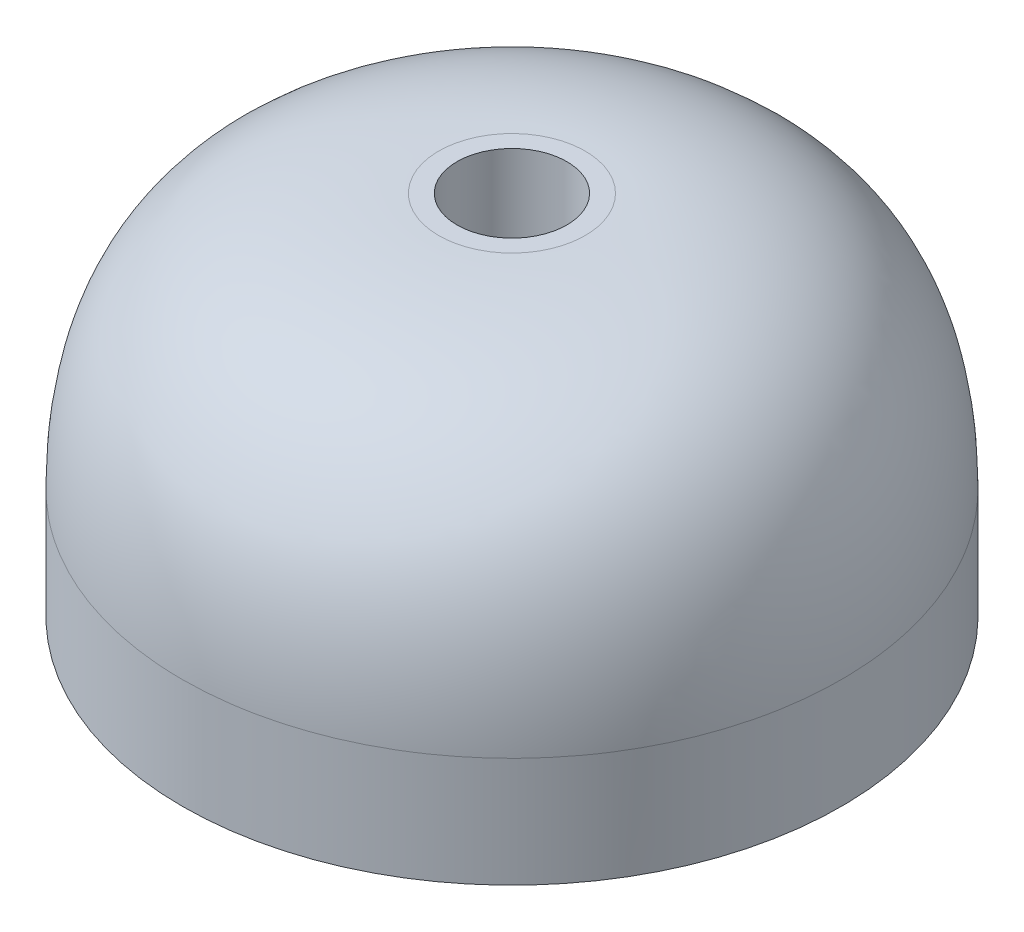
ISO-10303-21;
HEADER;
FILE_DESCRIPTION(('STEP AP214'),'2;1');
FILE_NAME('part.step','',(''),(''),'','','');
FILE_SCHEMA(('AUTOMOTIVE_DESIGN { 1 0 10303 214 1 1 1 1 }'));
ENDSEC;
DATA;
#1=APPLICATION_CONTEXT('core data for automotive mechanical design processes');
#2=APPLICATION_PROTOCOL_DEFINITION('international standard','automotive_design',2000,#1);
#3=PRODUCT_CONTEXT('',#1,'mechanical');
#4=PRODUCT('Part','Part','',(#3));
#5=PRODUCT_RELATED_PRODUCT_CATEGORY('part','',(#4));
#6=PRODUCT_DEFINITION_FORMATION('','',#4);
#7=PRODUCT_DEFINITION_CONTEXT('part definition',#1,'design');
#8=PRODUCT_DEFINITION('design','',#6,#7);
#9=PRODUCT_DEFINITION_SHAPE('','',#8);
#10=(LENGTH_UNIT() NAMED_UNIT(*) SI_UNIT(.MILLI.,.METRE.));
#11=(NAMED_UNIT(*) PLANE_ANGLE_UNIT() SI_UNIT($,.RADIAN.));
#12=(NAMED_UNIT(*) SI_UNIT($,.STERADIAN.) SOLID_ANGLE_UNIT());
#13=UNCERTAINTY_MEASURE_WITH_UNIT(LENGTH_MEASURE(1.E-05),#10,'distance_accuracy_value','');
#14=(GEOMETRIC_REPRESENTATION_CONTEXT(3) GLOBAL_UNCERTAINTY_ASSIGNED_CONTEXT((#13)) GLOBAL_UNIT_ASSIGNED_CONTEXT((#10,
#11,#12)) REPRESENTATION_CONTEXT('',''));
#15=CARTESIAN_POINT('',(0.,0.,0.));
#16=DIRECTION('',(0.,0.,1.));
#17=DIRECTION('',(1.,0.,0.));
#18=AXIS2_PLACEMENT_3D('',#15,#16,#17);
#19=CARTESIAN_POINT('',(0.,10.,0.));
#20=DIRECTION('',(0.,-1.,0.));
#21=DIRECTION('',(0.,0.,-1.));
#22=AXIS2_PLACEMENT_3D('',#19,#20,#21);
#23=CYLINDRICAL_SURFACE('',#22,9.);
#24=CARTESIAN_POINT('',(0.,3.,9.));
#25=CARTESIAN_POINT('',(1.17809719600875,3.,9.));
#26=CARTESIAN_POINT('',(2.3557310045845,3.,8.76575407122985));
#27=CARTESIAN_POINT('',(4.53257077798711,3.,7.86407751397331));
#28=CARTESIAN_POINT('',(5.53092051448413,3.,7.19700154687372));
#29=CARTESIAN_POINT('',(7.19700154687372,3.,5.53092051448413));
#30=CARTESIAN_POINT('',(7.86407751397326,3.,4.53257077798725));
#31=CARTESIAN_POINT('',(8.7657540712299,3.,2.35573100458436));
#32=CARTESIAN_POINT('',(9.,3.,1.17809719600879));
#33=CARTESIAN_POINT('',(9.,3.,-1.17809719600879));
#34=CARTESIAN_POINT('',(8.7657540712299,3.,-2.35573100458438));
#35=CARTESIAN_POINT('',(7.86407751397326,3.,-4.53257077798724));
#36=CARTESIAN_POINT('',(7.19700154687346,3.,-5.53092051448439));
#37=CARTESIAN_POINT('',(5.53092051448438,3.,-7.19700154687347));
#38=CARTESIAN_POINT('',(4.53257077798728,3.,-7.86407751397324));
#39=CARTESIAN_POINT('',(2.35573100458436,3.,-8.76575407122991));
#40=CARTESIAN_POINT('',(1.17809719600879,3.,-9.));
#41=CARTESIAN_POINT('',(-1.17809719600879,3.,-9.));
#42=CARTESIAN_POINT('',(-2.35573100458426,3.,-8.76575407122995));
#43=CARTESIAN_POINT('',(-4.53257077798734,3.,-7.86407751397322));
#44=CARTESIAN_POINT('',(-5.53092051448428,3.,-7.19700154687358));
#45=CARTESIAN_POINT('',(-7.19700154687358,3.,-5.53092051448427));
#46=CARTESIAN_POINT('',(-7.86407751397315,3.,-4.53257077798749));
#47=CARTESIAN_POINT('',(-8.76575407123,3.,-2.35573100458415));
#48=CARTESIAN_POINT('',(-9.,3.,-1.17809719600878));
#49=CARTESIAN_POINT('',(-9.,3.,1.1780971960088));
#50=CARTESIAN_POINT('',(-8.76575407122991,3.,2.35573100458435));
#51=CARTESIAN_POINT('',(-7.86407751397327,3.,4.53257077798724));
#52=CARTESIAN_POINT('',(-7.19700154687371,3.,5.53092051448414));
#53=CARTESIAN_POINT('',(-5.53092051448418,3.,7.19700154687368));
#54=CARTESIAN_POINT('',(-4.53257077798734,3.,7.86407751397322));
#55=CARTESIAN_POINT('',(-2.3557310045843,3.,8.76575407122993));
#56=CARTESIAN_POINT('',(-1.17809719600875,3.,9.));
#57=CARTESIAN_POINT('',(0.,3.,9.));
#58=(BOUNDED_CURVE() B_SPLINE_CURVE(3,(#24,#25,#26,#27,#28,#29,#30,#31,#32,#33,#34,#35,#36,#37,
#38,#39,#40,#41,#42,#43,#44,#45,#46,#47,#48,#49,#50,#51,#52,#53,#54,#55,#56,#57),.UNSPECIFIED.,
.T.,.F.) B_SPLINE_CURVE_WITH_KNOTS((4,2,2,2,2,2,2,2,2,2,2,2,2,2,2,2,4),(0.,0.392699081698724,
0.785398163397448,1.17809724509617,1.5707963267949,1.96349540849362,2.35619449019234,
2.74889357189107,3.14159265358979,3.53429173528852,3.92699081698724,4.31968989868597,
4.71238898038469,5.10508806208341,5.49778714378214,5.89048622548086,6.28318530717959),
.UNSPECIFIED.) CURVE() GEOMETRIC_REPRESENTATION_ITEM() RATIONAL_B_SPLINE_CURVE((1.,1.,1.,1.,1.,
1.,1.,1.,1.,1.,1.,1.,1.,1.,1.,1.,1.,1.,1.,1.,1.,1.,1.,1.,1.,1.,1.,1.,1.,1.,1.,1.,1.,1.)) REPRESENTATION_ITEM(''));
#59=CARTESIAN_POINT('',(0.,3.,9.));
#60=VERTEX_POINT('',#59);
#61=EDGE_CURVE('E11',#60,#60,#58,.F.);
#62=ORIENTED_EDGE('',*,*,#61,.T.);
#63=EDGE_LOOP('',(#62));
#64=FACE_BOUND('',#63,.T.);
#65=CARTESIAN_POINT('',(0.,0.,0.));
#66=DIRECTION('',(0.,1.,0.));
#67=DIRECTION('',(0.,0.,1.));
#68=AXIS2_PLACEMENT_3D('',#65,#66,#67);
#69=CIRCLE('',#68,9.);
#70=CARTESIAN_POINT('',(0.,0.,9.));
#71=VERTEX_POINT('',#70);
#72=EDGE_CURVE('E54',#71,#71,#69,.T.);
#73=ORIENTED_EDGE('',*,*,#72,.T.);
#74=EDGE_LOOP('',(#73));
#75=FACE_BOUND('',#74,.T.);
#76=ADVANCED_FACE('F36',(#64,#75),#23,.T.);
#77=CARTESIAN_POINT('',(0.,10.,0.));
#78=DIRECTION('',(0.,1.,0.));
#79=DIRECTION('',(0.,0.,1.));
#80=AXIS2_PLACEMENT_3D('',#77,#78,#79);
#81=PLANE('',#80);
#82=CARTESIAN_POINT('',(0.,10.,0.));
#83=DIRECTION('',(0.,1.,0.));
#84=DIRECTION('',(0.,0.,1.));
#85=AXIS2_PLACEMENT_3D('',#82,#83,#84);
#86=CIRCLE('',#85,1.5);
#87=CARTESIAN_POINT('',(0.,10.,1.5));
#88=VERTEX_POINT('',#87);
#89=EDGE_CURVE('E59',#88,#88,#86,.T.);
#90=ORIENTED_EDGE('',*,*,#89,.F.);
#91=EDGE_LOOP('',(#90));
#92=FACE_BOUND('',#91,.T.);
#93=CARTESIAN_POINT('',(0.,10.,2.));
#94=CARTESIAN_POINT('',(-0.261799376890833,10.,2.));
#95=CARTESIAN_POINT('',(-0.52349577879652,10.,1.94794534916223));
#96=CARTESIAN_POINT('',(-1.00723795066384,10.,1.74757278088291));
#97=CARTESIAN_POINT('',(-1.22909344766319,10.,1.59933367708303));
#98=CARTESIAN_POINT('',(-1.59933367708301,10.,1.22909344766315));
#99=CARTESIAN_POINT('',(-1.74757278088297,10.,1.00723795066384));
#100=CARTESIAN_POINT('',(-1.94794534916218,10.,0.523495778796514));
#101=CARTESIAN_POINT('',(-2.,10.,0.261799376890845));
#102=CARTESIAN_POINT('',(-2.,10.,-0.261799376890839));
#103=CARTESIAN_POINT('',(-1.94794534916223,10.,-0.523495778796505));
#104=CARTESIAN_POINT('',(-1.74757278088291,10.,-1.00723795066386));
#105=CARTESIAN_POINT('',(-1.59933367708301,10.,-1.22909344766315));
#106=CARTESIAN_POINT('',(-1.22909344766318,10.,-1.59933367708304));
#107=CARTESIAN_POINT('',(-1.00723795066384,10.,-1.74757278088294));
#108=CARTESIAN_POINT('',(-0.523495778796516,10.,-1.9479453491622));
#109=CARTESIAN_POINT('',(-0.261799376890841,10.,-2.));
#110=CARTESIAN_POINT('',(0.261799376890842,10.,-2.));
#111=CARTESIAN_POINT('',(0.523495778796522,10.,-1.94794534916223));
#112=CARTESIAN_POINT('',(1.00723795066384,10.,-1.74757278088291));
#113=CARTESIAN_POINT('',(1.22909344766318,10.,-1.59933367708298));
#114=CARTESIAN_POINT('',(1.59933367708301,10.,-1.22909344766321));
#115=CARTESIAN_POINT('',(1.74757278088293,10.,-1.00723795066382));
#116=CARTESIAN_POINT('',(1.94794534916222,10.,-0.52349577879654));
#117=CARTESIAN_POINT('',(2.,10.,-0.261799376890842));
#118=CARTESIAN_POINT('',(2.,10.,0.261799376890842));
#119=CARTESIAN_POINT('',(1.94794534916219,10.,0.52349577879651));
#120=CARTESIAN_POINT('',(1.74757278088296,10.,1.00723795066385));
#121=CARTESIAN_POINT('',(1.59933367708304,10.,1.22909344766315));
#122=CARTESIAN_POINT('',(1.22909344766315,10.,1.59933367708304));
#123=CARTESIAN_POINT('',(1.00723795066382,10.,1.74757278088294));
#124=CARTESIAN_POINT('',(0.523495778796538,10.,1.94794534916221));
#125=CARTESIAN_POINT('',(0.261799376890833,10.,2.));
#126=CARTESIAN_POINT('',(0.,10.,2.));
#127=(BOUNDED_CURVE() B_SPLINE_CURVE(3,(#93,#94,#95,#96,#97,#98,#99,#100,#101,#102,#103,#104,
#105,#106,#107,#108,#109,#110,#111,#112,#113,#114,#115,#116,#117,#118,#119,#120,#121,#122,#123,
#124,#125,#126),.UNSPECIFIED.,.T.,.F.) B_SPLINE_CURVE_WITH_KNOTS((4,2,2,2,2,2,2,2,2,2,2,2,2,2,2,
2,4),(0.,0.392699081698725,0.785398163397448,1.17809724509617,1.5707963267949,1.96349540849362,
2.35619449019234,2.74889357189107,3.14159265358979,3.53429173528852,3.92699081698724,
4.31968989868597,4.71238898038469,5.10508806208341,5.49778714378214,5.89048622548086,
6.28318530717959),
.UNSPECIFIED.) CURVE() GEOMETRIC_REPRESENTATION_ITEM() RATIONAL_B_SPLINE_CURVE((1.,1.,1.,1.,1.,
1.,1.,1.,1.,1.,1.,1.,1.,1.,1.,1.,1.,1.,1.,1.,1.,1.,1.,1.,1.,1.,1.,1.,1.,1.,1.,1.,1.,1.)) REPRESENTATION_ITEM(''));
#128=CARTESIAN_POINT('',(0.,10.,2.));
#129=VERTEX_POINT('',#128);
#130=EDGE_CURVE('E49',#129,#129,#127,.F.);
#131=ORIENTED_EDGE('',*,*,#130,.T.);
#132=EDGE_LOOP('',(#131));
#133=FACE_BOUND('',#132,.T.);
#134=ADVANCED_FACE('F72',(#92,#133),#81,.T.);
#135=CARTESIAN_POINT('',(0.,0.,0.));
#136=DIRECTION('',(0.,1.,0.));
#137=DIRECTION('',(0.,0.,1.));
#138=AXIS2_PLACEMENT_3D('',#135,#136,#137);
#139=PLANE('',#138);
#140=CARTESIAN_POINT('',(0.,0.,0.));
#141=DIRECTION('',(0.,1.,0.));
#142=DIRECTION('',(0.,0.,1.));
#143=AXIS2_PLACEMENT_3D('',#140,#141,#142);
#144=CIRCLE('',#143,1.5);
#145=CARTESIAN_POINT('',(0.,0.,1.5));
#146=VERTEX_POINT('',#145);
#147=EDGE_CURVE('E64',#146,#146,#144,.T.);
#148=ORIENTED_EDGE('',*,*,#147,.T.);
#149=EDGE_LOOP('',(#148));
#150=FACE_BOUND('',#149,.T.);
#151=ORIENTED_EDGE('',*,*,#72,.F.);
#152=EDGE_LOOP('',(#151));
#153=FACE_BOUND('',#152,.T.);
#154=ADVANCED_FACE('F82',(#150,#153),#139,.F.);
#155=CARTESIAN_POINT('',(0.,10.,2.));
#156=CARTESIAN_POINT('',(0.261799376890833,10.,2.));
#157=CARTESIAN_POINT('',(0.523495778796538,10.,1.94794534916221));
#158=CARTESIAN_POINT('',(1.00723795066382,10.,1.74757278088294));
#159=CARTESIAN_POINT('',(1.22909344766315,10.,1.59933367708304));
#160=CARTESIAN_POINT('',(1.59933367708304,10.,1.22909344766315));
#161=CARTESIAN_POINT('',(1.74757278088296,10.,1.00723795066385));
#162=CARTESIAN_POINT('',(1.94794534916219,10.,0.52349577879651));
#163=CARTESIAN_POINT('',(2.,10.,0.261799376890842));
#164=CARTESIAN_POINT('',(2.,10.,-0.261799376890842));
#165=CARTESIAN_POINT('',(1.94794534916222,10.,-0.52349577879654));
#166=CARTESIAN_POINT('',(1.74757278088293,10.,-1.00723795066382));
#167=CARTESIAN_POINT('',(1.59933367708301,10.,-1.22909344766321));
#168=CARTESIAN_POINT('',(1.22909344766318,10.,-1.59933367708298));
#169=CARTESIAN_POINT('',(1.00723795066384,10.,-1.74757278088291));
#170=CARTESIAN_POINT('',(0.523495778796522,10.,-1.94794534916223));
#171=CARTESIAN_POINT('',(0.261799376890842,10.,-2.));
#172=CARTESIAN_POINT('',(-0.261799376890841,10.,-2.));
#173=CARTESIAN_POINT('',(-0.523495778796516,10.,-1.9479453491622));
#174=CARTESIAN_POINT('',(-1.00723795066384,10.,-1.74757278088294));
#175=CARTESIAN_POINT('',(-1.22909344766318,10.,-1.59933367708304));
#176=CARTESIAN_POINT('',(-1.59933367708301,10.,-1.22909344766315));
#177=CARTESIAN_POINT('',(-1.74757278088291,10.,-1.00723795066386));
#178=CARTESIAN_POINT('',(-1.94794534916223,10.,-0.523495778796505));
#179=CARTESIAN_POINT('',(-2.,10.,-0.261799376890839));
#180=CARTESIAN_POINT('',(-2.,10.,0.261799376890845));
#181=CARTESIAN_POINT('',(-1.94794534916218,10.,0.523495778796514));
#182=CARTESIAN_POINT('',(-1.74757278088297,10.,1.00723795066384));
#183=CARTESIAN_POINT('',(-1.59933367708301,10.,1.22909344766315));
#184=CARTESIAN_POINT('',(-1.22909344766319,10.,1.59933367708303));
#185=CARTESIAN_POINT('',(-1.00723795066384,10.,1.74757278088291));
#186=CARTESIAN_POINT('',(-0.52349577879652,10.,1.94794534916223));
#187=CARTESIAN_POINT('',(-0.261799376890833,10.,2.));
#188=CARTESIAN_POINT('',(0.,10.,2.));
#189=CARTESIAN_POINT('',(0.,10.,9.));
#190=CARTESIAN_POINT('',(1.17809719600875,10.,9.));
#191=CARTESIAN_POINT('',(2.35573100458455,10.,8.76575407122982));
#192=CARTESIAN_POINT('',(4.53257077798707,10.,7.86407751397334));
#193=CARTESIAN_POINT('',(5.5309205144843,10.0000000000002,7.19700154687389));
#194=CARTESIAN_POINT('',(7.19700154687355,9.99999999999977,5.53092051448396));
#195=CARTESIAN_POINT('',(7.86407751397351,10.,4.53257077798735));
#196=CARTESIAN_POINT('',(8.76575407122965,10.,2.35573100458425));
#197=CARTESIAN_POINT('',(9.,10.,1.17809719600879));
#198=CARTESIAN_POINT('',(9.,10.,-1.17809719600879));
#199=CARTESIAN_POINT('',(8.76575407122987,9.99999999999977,-2.35573100458426));
#200=CARTESIAN_POINT('',(7.86407751397329,10.0000000000002,-4.53257077798736));
#201=CARTESIAN_POINT('',(7.19700154687341,9.99999999999955,-5.53092051448434));
#202=CARTESIAN_POINT('',(5.53092051448444,10.0000000000005,-7.19700154687353));
#203=CARTESIAN_POINT('',(4.53257077798728,10.0000000000002,-7.86407751397325));
#204=CARTESIAN_POINT('',(2.35573100458436,9.99999999999977,-8.76575407122989));
#205=CARTESIAN_POINT('',(1.17809719600879,10.,-9.));
#206=CARTESIAN_POINT('',(-1.17809719600879,10.,-9.));
#207=CARTESIAN_POINT('',(-2.35573100458433,10.0000000000002,-8.76575407123013));
#208=CARTESIAN_POINT('',(-4.53257077798726,9.99999999999977,-7.86407751397304));
#209=CARTESIAN_POINT('',(-5.53092051448411,9.99999999999955,-7.19700154687329));
#210=CARTESIAN_POINT('',(-7.19700154687375,10.0000000000005,-5.53092051448456));
#211=CARTESIAN_POINT('',(-7.86407751397308,10.0000000000002,-4.53257077798751));
#212=CARTESIAN_POINT('',(-8.76575407123007,9.99999999999977,-2.35573100458413));
#213=CARTESIAN_POINT('',(-9.,10.,-1.17809719600878));
#214=CARTESIAN_POINT('',(-9.,10.,1.1780971960088));
#215=CARTESIAN_POINT('',(-8.76575407122986,10.0000000000005,2.35573100458444));
#216=CARTESIAN_POINT('',(-7.86407751397332,9.99999999999955,4.53257077798715));
#217=CARTESIAN_POINT('',(-7.19700154687371,10.,5.53092051448426));
#218=CARTESIAN_POINT('',(-5.53092051448418,10.,7.19700154687356));
#219=CARTESIAN_POINT('',(-4.53257077798734,10.,7.86407751397308));
#220=CARTESIAN_POINT('',(-2.3557310045843,10.,8.76575407123007));
#221=CARTESIAN_POINT('',(-1.17809719600875,10.,9.));
#222=CARTESIAN_POINT('',(0.,10.,9.));
#223=CARTESIAN_POINT('',(0.,3.,9.));
#224=CARTESIAN_POINT('',(1.17809719600875,3.,9.));
#225=CARTESIAN_POINT('',(2.3557310045845,3.,8.76575407122985));
#226=CARTESIAN_POINT('',(4.53257077798711,3.,7.86407751397331));
#227=CARTESIAN_POINT('',(5.53092051448413,3.,7.19700154687372));
#228=CARTESIAN_POINT('',(7.19700154687372,3.,5.53092051448413));
#229=CARTESIAN_POINT('',(7.86407751397326,3.,4.53257077798725));
#230=CARTESIAN_POINT('',(8.7657540712299,3.,2.35573100458436));
#231=CARTESIAN_POINT('',(9.,3.,1.17809719600879));
#232=CARTESIAN_POINT('',(9.,3.,-1.17809719600879));
#233=CARTESIAN_POINT('',(8.7657540712299,3.,-2.35573100458438));
#234=CARTESIAN_POINT('',(7.86407751397326,3.,-4.53257077798724));
#235=CARTESIAN_POINT('',(7.19700154687346,3.,-5.53092051448439));
#236=CARTESIAN_POINT('',(5.53092051448438,3.,-7.19700154687347));
#237=CARTESIAN_POINT('',(4.53257077798728,3.,-7.86407751397324));
#238=CARTESIAN_POINT('',(2.35573100458436,3.,-8.76575407122991));
#239=CARTESIAN_POINT('',(1.17809719600879,3.,-9.));
#240=CARTESIAN_POINT('',(-1.17809719600879,3.,-9.));
#241=CARTESIAN_POINT('',(-2.35573100458426,3.,-8.76575407122995));
#242=CARTESIAN_POINT('',(-4.53257077798734,3.,-7.86407751397322));
#243=CARTESIAN_POINT('',(-5.53092051448428,3.,-7.19700154687358));
#244=CARTESIAN_POINT('',(-7.19700154687358,3.,-5.53092051448427));
#245=CARTESIAN_POINT('',(-7.86407751397315,3.,-4.53257077798749));
#246=CARTESIAN_POINT('',(-8.76575407123,3.,-2.35573100458415));
#247=CARTESIAN_POINT('',(-9.,3.,-1.17809719600878));
#248=CARTESIAN_POINT('',(-9.,3.,1.1780971960088));
#249=CARTESIAN_POINT('',(-8.76575407122991,3.,2.35573100458435));
#250=CARTESIAN_POINT('',(-7.86407751397327,3.,4.53257077798724));
#251=CARTESIAN_POINT('',(-7.19700154687371,3.,5.53092051448414));
#252=CARTESIAN_POINT('',(-5.53092051448418,3.,7.19700154687368));
#253=CARTESIAN_POINT('',(-4.53257077798734,3.,7.86407751397322));
#254=CARTESIAN_POINT('',(-2.3557310045843,3.,8.76575407122993));
#255=CARTESIAN_POINT('',(-1.17809719600875,3.,9.));
#256=CARTESIAN_POINT('',(0.,3.,9.));
#257=(BOUNDED_SURFACE() B_SPLINE_SURFACE(2,3,((#155,#156,#157,#158,#159,#160,#161,#162,#163,
#164,#165,#166,#167,#168,#169,#170,#171,#172,#173,#174,#175,#176,#177,#178,#179,#180,#181,#182,
#183,#184,#185,#186,#187,#188),(#189,#190,#191,#192,#193,#194,#195,#196,#197,#198,#199,#200,
#201,#202,#203,#204,#205,#206,#207,#208,#209,#210,#211,#212,#213,#214,#215,#216,#217,#218,#219,
#220,#221,#222),(#223,#224,#225,#226,#227,#228,#229,#230,#231,#232,#233,#234,#235,#236,#237,
#238,#239,#240,#241,#242,#243,#244,#245,#246,#247,#248,#249,#250,#251,#252,#253,#254,#255,
#256)),.UNSPECIFIED.,.F.,.T.,.F.) B_SPLINE_SURFACE_WITH_KNOTS((3,3),(4,2,2,2,2,2,2,2,2,2,2,2,2,
2,2,2,4),(0.,1.),(0.,0.392699081698724,0.785398163397448,1.17809724509617,1.5707963267949,
1.96349540849362,2.35619449019234,2.74889357189107,3.14159265358979,3.53429173528852,
3.92699081698724,4.31968989868597,4.71238898038469,5.10508806208341,5.49778714378214,
5.89048622548086,6.28318530717959),
.UNSPECIFIED.) GEOMETRIC_REPRESENTATION_ITEM() RATIONAL_B_SPLINE_SURFACE(((1.,1.,1.,1.,1.,1.,1.,
1.,1.,1.,1.,1.,1.,1.,1.,1.,1.,1.,1.,1.,1.,1.,1.,1.,1.,1.,1.,1.,1.,1.,1.,1.,1.,1.),(1.,1.,1.,1.,
1.,1.,1.,1.,1.,1.,1.,1.,1.,1.,1.,1.,1.,1.,1.,1.,1.,1.,1.,1.,1.,1.,1.,1.,1.,1.,1.,1.,1.,1.),(1.,
1.,1.,1.,1.,1.,1.,1.,1.,1.,1.,1.,1.,1.,1.,1.,1.,1.,1.,1.,1.,1.,1.,1.,1.,1.,1.,1.,1.,1.,1.,1.,1.,1.))) REPRESENTATION_ITEM('') SURFACE());
#258=ORIENTED_EDGE('',*,*,#61,.F.);
#259=EDGE_LOOP('',(#258));
#260=FACE_BOUND('',#259,.T.);
#261=ORIENTED_EDGE('',*,*,#130,.F.);
#262=EDGE_LOOP('',(#261));
#263=FACE_BOUND('',#262,.T.);
#264=ADVANCED_FACE('F39',(#260,#263),#257,.T.);
#265=CARTESIAN_POINT('',(0.,10.036,0.));
#266=DIRECTION('',(0.,-1.,0.));
#267=DIRECTION('',(0.,0.,-1.));
#268=AXIS2_PLACEMENT_3D('',#265,#266,#267);
#269=CYLINDRICAL_SURFACE('',#268,1.5);
#270=ORIENTED_EDGE('',*,*,#89,.T.);
#271=EDGE_LOOP('',(#270));
#272=FACE_BOUND('',#271,.T.);
#273=ORIENTED_EDGE('',*,*,#147,.F.);
#274=EDGE_LOOP('',(#273));
#275=FACE_BOUND('',#274,.T.);
#276=ADVANCED_FACE('F84',(#272,#275),#269,.F.);
#277=CLOSED_SHELL('',(#76,#134,#154,#264,#276));
#278=MANIFOLD_SOLID_BREP('B2',#277);
#279=ADVANCED_BREP_SHAPE_REPRESENTATION('',(#18,#278),#14);
#280=SHAPE_DEFINITION_REPRESENTATION(#9,#279);
ENDSEC;
END-ISO-10303-21;
